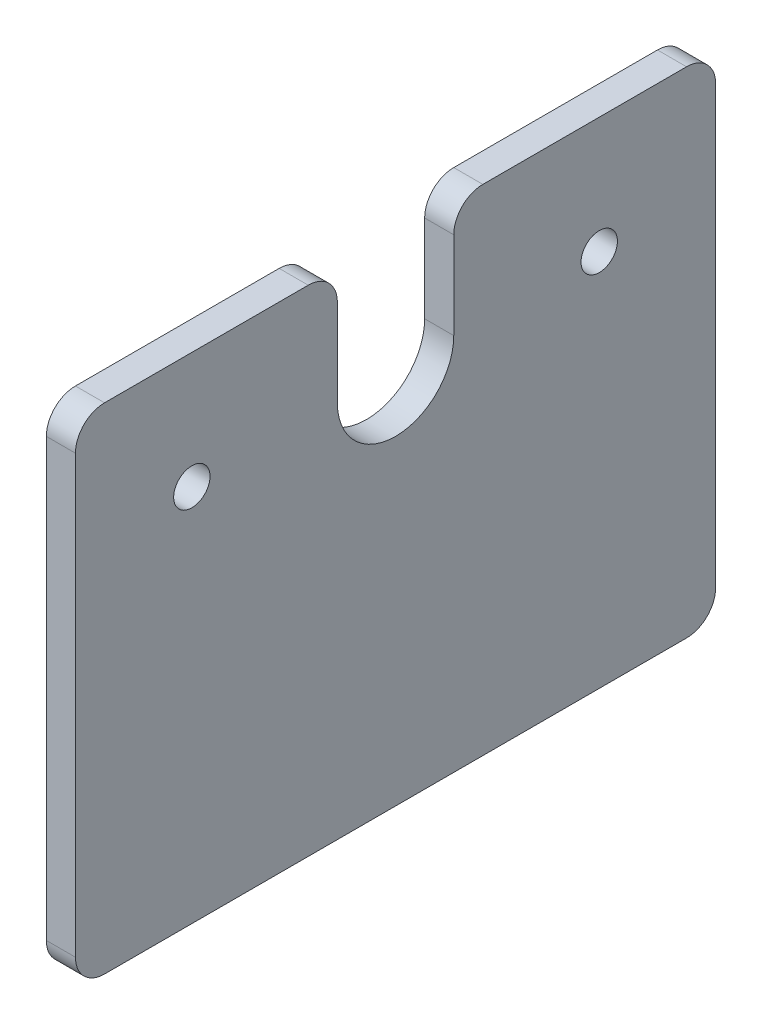
ISO-10303-21;
HEADER;
FILE_DESCRIPTION(('STEP AP214'),'2;1');
FILE_NAME('part.step','',(''),(''),'','','');
FILE_SCHEMA(('AUTOMOTIVE_DESIGN { 1 0 10303 214 1 1 1 1 }'));
ENDSEC;
DATA;
#1=APPLICATION_CONTEXT('core data for automotive mechanical design processes');
#2=APPLICATION_PROTOCOL_DEFINITION('international standard','automotive_design',2000,#1);
#3=PRODUCT_CONTEXT('',#1,'mechanical');
#4=PRODUCT('Part','Part','',(#3));
#5=PRODUCT_RELATED_PRODUCT_CATEGORY('part','',(#4));
#6=PRODUCT_DEFINITION_FORMATION('','',#4);
#7=PRODUCT_DEFINITION_CONTEXT('part definition',#1,'design');
#8=PRODUCT_DEFINITION('design','',#6,#7);
#9=PRODUCT_DEFINITION_SHAPE('','',#8);
#10=(LENGTH_UNIT() NAMED_UNIT(*) SI_UNIT(.MILLI.,.METRE.));
#11=(NAMED_UNIT(*) PLANE_ANGLE_UNIT() SI_UNIT($,.RADIAN.));
#12=(NAMED_UNIT(*) SI_UNIT($,.STERADIAN.) SOLID_ANGLE_UNIT());
#13=UNCERTAINTY_MEASURE_WITH_UNIT(LENGTH_MEASURE(1.E-05),#10,'distance_accuracy_value','');
#14=(GEOMETRIC_REPRESENTATION_CONTEXT(3) GLOBAL_UNCERTAINTY_ASSIGNED_CONTEXT((#13)) GLOBAL_UNIT_ASSIGNED_CONTEXT((#10,
#11,#12)) REPRESENTATION_CONTEXT('',''));
#15=CARTESIAN_POINT('',(0.,0.,0.));
#16=DIRECTION('',(0.,0.,1.));
#17=DIRECTION('',(1.,0.,0.));
#18=AXIS2_PLACEMENT_3D('',#15,#16,#17);
#19=CARTESIAN_POINT('',(512.,198.,307.5));
#20=DIRECTION('',(0.,1.,0.));
#21=DIRECTION('',(0.,0.,1.));
#22=AXIS2_PLACEMENT_3D('',#19,#20,#21);
#23=PLANE('',#22);
#24=DIRECTION('',(0.,0.,1.));
#25=VECTOR('',#24,1.);
#26=CARTESIAN_POINT('',(522.,198.,307.5));
#27=LINE('',#26,#25);
#28=CARTESIAN_POINT('',(522.,198.,227.5));
#29=VERTEX_POINT('',#28);
#30=CARTESIAN_POINT('',(522.,198.,297.5));
#31=VERTEX_POINT('',#30);
#32=EDGE_CURVE('E194',#29,#31,#27,.T.);
#33=ORIENTED_EDGE('',*,*,#32,.F.);
#34=DIRECTION('',(1.,0.,0.));
#35=VECTOR('',#34,1.);
#36=CARTESIAN_POINT('',(512.,198.,227.5));
#37=LINE('',#36,#35);
#38=CARTESIAN_POINT('',(512.,198.,227.5));
#39=VERTEX_POINT('',#38);
#40=EDGE_CURVE('E217',#29,#39,#37,.F.);
#41=ORIENTED_EDGE('',*,*,#40,.T.);
#42=DIRECTION('',(0.,0.,1.));
#43=VECTOR('',#42,1.);
#44=CARTESIAN_POINT('',(512.,198.,307.5));
#45=LINE('',#44,#43);
#46=CARTESIAN_POINT('',(512.,198.,297.5));
#47=VERTEX_POINT('',#46);
#48=EDGE_CURVE('E181',#39,#47,#45,.T.);
#49=ORIENTED_EDGE('',*,*,#48,.T.);
#50=DIRECTION('',(1.,0.,0.));
#51=VECTOR('',#50,1.);
#52=CARTESIAN_POINT('',(512.,198.,297.5));
#53=LINE('',#52,#51);
#54=EDGE_CURVE('E214',#47,#31,#53,.T.);
#55=ORIENTED_EDGE('',*,*,#54,.T.);
#56=EDGE_LOOP('',(#33,#41,#49,#55));
#57=FACE_BOUND('',#56,.T.);
#58=ADVANCED_FACE('F37',(#57),#23,.T.);
#59=CARTESIAN_POINT('',(512.,27.9999999999999,307.5));
#60=DIRECTION('',(0.,0.,1.));
#61=DIRECTION('',(1.,0.,0.));
#62=AXIS2_PLACEMENT_3D('',#59,#60,#61);
#63=PLANE('',#62);
#64=DIRECTION('',(0.,-1.,0.));
#65=VECTOR('',#64,1.);
#66=CARTESIAN_POINT('',(512.,27.9999999999999,307.5));
#67=LINE('',#66,#65);
#68=CARTESIAN_POINT('',(512.,188.,307.5));
#69=VERTEX_POINT('',#68);
#70=CARTESIAN_POINT('',(512.,37.9999999999999,307.5));
#71=VERTEX_POINT('',#70);
#72=EDGE_CURVE('E172',#69,#71,#67,.T.);
#73=ORIENTED_EDGE('',*,*,#72,.T.);
#74=DIRECTION('',(1.,0.,0.));
#75=VECTOR('',#74,1.);
#76=CARTESIAN_POINT('',(512.,37.9999999999999,307.5));
#77=LINE('',#76,#75);
#78=CARTESIAN_POINT('',(522.,37.9999999999999,307.5));
#79=VERTEX_POINT('',#78);
#80=EDGE_CURVE('E45',#71,#79,#77,.T.);
#81=ORIENTED_EDGE('',*,*,#80,.T.);
#82=DIRECTION('',(0.,-1.,0.));
#83=VECTOR('',#82,1.);
#84=CARTESIAN_POINT('',(522.,27.9999999999999,307.5));
#85=LINE('',#84,#83);
#86=CARTESIAN_POINT('',(522.,188.,307.5));
#87=VERTEX_POINT('',#86);
#88=EDGE_CURVE('E171',#87,#79,#85,.T.);
#89=ORIENTED_EDGE('',*,*,#88,.F.);
#90=DIRECTION('',(1.,0.,0.));
#91=VECTOR('',#90,1.);
#92=CARTESIAN_POINT('',(512.,188.,307.5));
#93=LINE('',#92,#91);
#94=EDGE_CURVE('E59',#87,#69,#93,.F.);
#95=ORIENTED_EDGE('',*,*,#94,.T.);
#96=EDGE_LOOP('',(#73,#81,#89,#95));
#97=FACE_BOUND('',#96,.T.);
#98=ADVANCED_FACE('F246',(#97),#63,.T.);
#99=CARTESIAN_POINT('',(522.,198.,97.4999999999998));
#100=VERTEX_POINT('',#99);
#101=CARTESIAN_POINT('',(522.,198.,167.5));
#102=VERTEX_POINT('',#101);
#103=EDGE_CURVE('E175',#100,#102,#27,.T.);
#104=ORIENTED_EDGE('',*,*,#103,.F.);
#105=DIRECTION('',(1.,0.,0.));
#106=VECTOR('',#105,1.);
#107=CARTESIAN_POINT('',(512.,198.,97.4999999999998));
#108=LINE('',#107,#106);
#109=CARTESIAN_POINT('',(512.,198.,97.4999999999998));
#110=VERTEX_POINT('',#109);
#111=EDGE_CURVE('E237',#100,#110,#108,.F.);
#112=ORIENTED_EDGE('',*,*,#111,.T.);
#113=CARTESIAN_POINT('',(512.,198.,167.5));
#114=VERTEX_POINT('',#113);
#115=EDGE_CURVE('E182',#110,#114,#45,.T.);
#116=ORIENTED_EDGE('',*,*,#115,.T.);
#117=DIRECTION('',(-1.,0.,0.));
#118=VECTOR('',#117,1.);
#119=CARTESIAN_POINT('',(522.,198.,167.5));
#120=LINE('',#119,#118);
#121=EDGE_CURVE('E235',#114,#102,#120,.F.);
#122=ORIENTED_EDGE('',*,*,#121,.T.);
#123=EDGE_LOOP('',(#104,#112,#116,#122));
#124=FACE_BOUND('',#123,.T.);
#125=ADVANCED_FACE('F297',(#124),#23,.T.);
#126=CARTESIAN_POINT('',(512.,27.9999999999999,87.4999999999998));
#127=DIRECTION('',(0.,0.,-1.));
#128=DIRECTION('',(-1.,0.,0.));
#129=AXIS2_PLACEMENT_3D('',#126,#127,#128);
#130=PLANE('',#129);
#131=DIRECTION('',(0.,1.,0.));
#132=VECTOR('',#131,1.);
#133=CARTESIAN_POINT('',(512.,27.9999999999999,87.4999999999998));
#134=LINE('',#133,#132);
#135=CARTESIAN_POINT('',(512.,37.9999999999999,87.4999999999998));
#136=VERTEX_POINT('',#135);
#137=CARTESIAN_POINT('',(512.,188.,87.4999999999998));
#138=VERTEX_POINT('',#137);
#139=EDGE_CURVE('E178',#136,#138,#134,.T.);
#140=ORIENTED_EDGE('',*,*,#139,.T.);
#141=DIRECTION('',(1.,0.,0.));
#142=VECTOR('',#141,1.);
#143=CARTESIAN_POINT('',(512.,188.,87.4999999999998));
#144=LINE('',#143,#142);
#145=CARTESIAN_POINT('',(522.,188.,87.4999999999998));
#146=VERTEX_POINT('',#145);
#147=EDGE_CURVE('E232',#138,#146,#144,.T.);
#148=ORIENTED_EDGE('',*,*,#147,.T.);
#149=DIRECTION('',(0.,1.,0.));
#150=VECTOR('',#149,1.);
#151=CARTESIAN_POINT('',(522.,27.9999999999999,87.4999999999998));
#152=LINE('',#151,#150);
#153=CARTESIAN_POINT('',(522.,37.9999999999999,87.4999999999998));
#154=VERTEX_POINT('',#153);
#155=EDGE_CURVE('E191',#154,#146,#152,.T.);
#156=ORIENTED_EDGE('',*,*,#155,.F.);
#157=DIRECTION('',(1.,0.,0.));
#158=VECTOR('',#157,1.);
#159=CARTESIAN_POINT('',(512.,37.9999999999999,87.4999999999998));
#160=LINE('',#159,#158);
#161=EDGE_CURVE('E230',#154,#136,#160,.F.);
#162=ORIENTED_EDGE('',*,*,#161,.T.);
#163=EDGE_LOOP('',(#140,#148,#156,#162));
#164=FACE_BOUND('',#163,.T.);
#165=ADVANCED_FACE('F290',(#164),#130,.T.);
#166=CARTESIAN_POINT('',(512.,27.9999999999999,307.5));
#167=DIRECTION('',(0.,-1.,0.));
#168=DIRECTION('',(0.,0.,-1.));
#169=AXIS2_PLACEMENT_3D('',#166,#167,#168);
#170=PLANE('',#169);
#171=DIRECTION('',(0.,0.,-1.));
#172=VECTOR('',#171,1.);
#173=CARTESIAN_POINT('',(512.,27.9999999999999,307.5));
#174=LINE('',#173,#172);
#175=CARTESIAN_POINT('',(512.,27.9999999999999,297.5));
#176=VERTEX_POINT('',#175);
#177=CARTESIAN_POINT('',(512.,27.9999999999999,97.4999999999998));
#178=VERTEX_POINT('',#177);
#179=EDGE_CURVE('E174',#176,#178,#174,.T.);
#180=ORIENTED_EDGE('',*,*,#179,.T.);
#181=DIRECTION('',(1.,0.,0.));
#182=VECTOR('',#181,1.);
#183=CARTESIAN_POINT('',(512.,27.9999999999999,97.4999999999998));
#184=LINE('',#183,#182);
#185=CARTESIAN_POINT('',(522.,27.9999999999999,97.4999999999998));
#186=VERTEX_POINT('',#185);
#187=EDGE_CURVE('E241',#178,#186,#184,.T.);
#188=ORIENTED_EDGE('',*,*,#187,.T.);
#189=DIRECTION('',(0.,0.,-1.));
#190=VECTOR('',#189,1.);
#191=CARTESIAN_POINT('',(522.,27.9999999999999,307.5));
#192=LINE('',#191,#190);
#193=CARTESIAN_POINT('',(522.,27.9999999999999,297.5));
#194=VERTEX_POINT('',#193);
#195=EDGE_CURVE('E188',#194,#186,#192,.T.);
#196=ORIENTED_EDGE('',*,*,#195,.F.);
#197=DIRECTION('',(1.,0.,0.));
#198=VECTOR('',#197,1.);
#199=CARTESIAN_POINT('',(512.,27.9999999999999,297.5));
#200=LINE('',#199,#198);
#201=EDGE_CURVE('E239',#194,#176,#200,.F.);
#202=ORIENTED_EDGE('',*,*,#201,.T.);
#203=EDGE_LOOP('',(#180,#188,#196,#202));
#204=FACE_BOUND('',#203,.T.);
#205=ADVANCED_FACE('F281',(#204),#170,.T.);
#206=CARTESIAN_POINT('',(512.,0.,0.));
#207=DIRECTION('',(-1.,0.,0.));
#208=DIRECTION('',(0.,0.,1.));
#209=AXIS2_PLACEMENT_3D('',#206,#207,#208);
#210=PLANE('',#209);
#211=CARTESIAN_POINT('',(512.,158.,267.5));
#212=DIRECTION('',(-1.,0.,0.));
#213=DIRECTION('',(0.,0.,-1.));
#214=AXIS2_PLACEMENT_3D('',#211,#212,#213);
#215=CIRCLE('',#214,6.25);
#216=CARTESIAN_POINT('',(512.,158.,261.25));
#217=VERTEX_POINT('',#216);
#218=EDGE_CURVE('E270',#217,#217,#215,.T.);
#219=ORIENTED_EDGE('',*,*,#218,.F.);
#220=EDGE_LOOP('',(#219));
#221=FACE_BOUND('',#220,.T.);
#222=CARTESIAN_POINT('',(512.,158.,127.5));
#223=DIRECTION('',(-1.,0.,0.));
#224=DIRECTION('',(0.,0.,1.));
#225=AXIS2_PLACEMENT_3D('',#222,#223,#224);
#226=CIRCLE('',#225,6.25);
#227=CARTESIAN_POINT('',(512.,158.,133.75));
#228=VERTEX_POINT('',#227);
#229=EDGE_CURVE('E269',#228,#228,#226,.T.);
#230=ORIENTED_EDGE('',*,*,#229,.F.);
#231=EDGE_LOOP('',(#230));
#232=FACE_BOUND('',#231,.T.);
#233=ORIENTED_EDGE('',*,*,#48,.F.);
#234=CARTESIAN_POINT('',(512.,188.,227.5));
#235=DIRECTION('',(-1.,0.,0.));
#236=DIRECTION('',(0.,0.,1.));
#237=AXIS2_PLACEMENT_3D('',#234,#235,#236);
#238=CIRCLE('',#237,10.);
#239=CARTESIAN_POINT('',(512.,188.,217.5));
#240=VERTEX_POINT('',#239);
#241=EDGE_CURVE('E228',#39,#240,#238,.T.);
#242=ORIENTED_EDGE('',*,*,#241,.T.);
#243=DIRECTION('',(0.,1.,0.));
#244=VECTOR('',#243,1.);
#245=CARTESIAN_POINT('',(512.,238.,217.5));
#246=LINE('',#245,#244);
#247=CARTESIAN_POINT('',(512.,158.,217.5));
#248=VERTEX_POINT('',#247);
#249=EDGE_CURVE('E159',#248,#240,#246,.T.);
#250=ORIENTED_EDGE('',*,*,#249,.F.);
#251=CARTESIAN_POINT('',(512.,158.,197.5));
#252=DIRECTION('',(-1.,0.,0.));
#253=DIRECTION('',(0.,0.,1.));
#254=AXIS2_PLACEMENT_3D('',#251,#252,#253);
#255=CIRCLE('',#254,19.9999999999999);
#256=CARTESIAN_POINT('',(512.,158.,177.5));
#257=VERTEX_POINT('',#256);
#258=EDGE_CURVE('E147',#257,#248,#255,.T.);
#259=ORIENTED_EDGE('',*,*,#258,.F.);
#260=DIRECTION('',(0.,-1.,0.));
#261=VECTOR('',#260,1.);
#262=CARTESIAN_POINT('',(512.,238.,177.5));
#263=LINE('',#262,#261);
#264=CARTESIAN_POINT('',(512.,188.,177.5));
#265=VERTEX_POINT('',#264);
#266=EDGE_CURVE('E139',#265,#257,#263,.T.);
#267=ORIENTED_EDGE('',*,*,#266,.F.);
#268=CARTESIAN_POINT('',(512.,188.,167.5));
#269=DIRECTION('',(-1.,0.,0.));
#270=DIRECTION('',(0.,0.,1.));
#271=AXIS2_PLACEMENT_3D('',#268,#269,#270);
#272=CIRCLE('',#271,10.);
#273=EDGE_CURVE('E221',#265,#114,#272,.T.);
#274=ORIENTED_EDGE('',*,*,#273,.T.);
#275=ORIENTED_EDGE('',*,*,#115,.F.);
#276=CARTESIAN_POINT('',(512.,188.,97.4999999999998));
#277=DIRECTION('',(-1.,0.,0.));
#278=DIRECTION('',(0.,0.,1.));
#279=AXIS2_PLACEMENT_3D('',#276,#277,#278);
#280=CIRCLE('',#279,10.);
#281=EDGE_CURVE('E226',#110,#138,#280,.T.);
#282=ORIENTED_EDGE('',*,*,#281,.T.);
#283=ORIENTED_EDGE('',*,*,#139,.F.);
#284=CARTESIAN_POINT('',(512.,37.9999999999999,97.4999999999998));
#285=DIRECTION('',(-1.,0.,0.));
#286=DIRECTION('',(0.,0.,1.));
#287=AXIS2_PLACEMENT_3D('',#284,#285,#286);
#288=CIRCLE('',#287,10.);
#289=EDGE_CURVE('E224',#136,#178,#288,.T.);
#290=ORIENTED_EDGE('',*,*,#289,.T.);
#291=ORIENTED_EDGE('',*,*,#179,.F.);
#292=CARTESIAN_POINT('',(512.,37.9999999999999,297.5));
#293=DIRECTION('',(-1.,0.,0.));
#294=DIRECTION('',(0.,0.,1.));
#295=AXIS2_PLACEMENT_3D('',#292,#293,#294);
#296=CIRCLE('',#295,10.);
#297=EDGE_CURVE('E52',#176,#71,#296,.T.);
#298=ORIENTED_EDGE('',*,*,#297,.T.);
#299=ORIENTED_EDGE('',*,*,#72,.F.);
#300=CARTESIAN_POINT('',(512.,188.,297.5));
#301=DIRECTION('',(-1.,0.,0.));
#302=DIRECTION('',(0.,0.,1.));
#303=AXIS2_PLACEMENT_3D('',#300,#301,#302);
#304=CIRCLE('',#303,10.);
#305=EDGE_CURVE('E219',#69,#47,#304,.T.);
#306=ORIENTED_EDGE('',*,*,#305,.T.);
#307=EDGE_LOOP('',(#233,#242,#250,#259,#267,#274,#275,#282,#283,#290,#291,#298,#299,#306));
#308=FACE_BOUND('',#307,.T.);
#309=ADVANCED_FACE('F162',(#221,#232,#308),#210,.T.);
#310=CARTESIAN_POINT('',(522.,0.,0.));
#311=DIRECTION('',(-1.,0.,0.));
#312=DIRECTION('',(0.,0.,1.));
#313=AXIS2_PLACEMENT_3D('',#310,#311,#312);
#314=PLANE('',#313);
#315=CARTESIAN_POINT('',(522.,158.,267.5));
#316=DIRECTION('',(-1.,0.,0.));
#317=DIRECTION('',(0.,0.,1.));
#318=AXIS2_PLACEMENT_3D('',#315,#316,#317);
#319=CIRCLE('',#318,6.25);
#320=CARTESIAN_POINT('',(522.,158.,273.75));
#321=VERTEX_POINT('',#320);
#322=EDGE_CURVE('E266',#321,#321,#319,.F.);
#323=ORIENTED_EDGE('',*,*,#322,.F.);
#324=EDGE_LOOP('',(#323));
#325=FACE_BOUND('',#324,.T.);
#326=CARTESIAN_POINT('',(522.,158.,127.5));
#327=DIRECTION('',(-1.,0.,0.));
#328=DIRECTION('',(0.,0.,1.));
#329=AXIS2_PLACEMENT_3D('',#326,#327,#328);
#330=CIRCLE('',#329,6.25);
#331=CARTESIAN_POINT('',(522.,158.,133.75));
#332=VERTEX_POINT('',#331);
#333=EDGE_CURVE('E148',#332,#332,#330,.F.);
#334=ORIENTED_EDGE('',*,*,#333,.F.);
#335=EDGE_LOOP('',(#334));
#336=FACE_BOUND('',#335,.T.);
#337=DIRECTION('',(0.,1.,0.));
#338=VECTOR('',#337,1.);
#339=CARTESIAN_POINT('',(522.,0.,217.5));
#340=LINE('',#339,#338);
#341=CARTESIAN_POINT('',(522.,158.,217.5));
#342=VERTEX_POINT('',#341);
#343=CARTESIAN_POINT('',(522.,188.,217.5));
#344=VERTEX_POINT('',#343);
#345=EDGE_CURVE('E185',#342,#344,#340,.T.);
#346=ORIENTED_EDGE('',*,*,#345,.T.);
#347=CARTESIAN_POINT('',(522.,188.,227.5));
#348=DIRECTION('',(-1.,0.,0.));
#349=DIRECTION('',(0.,0.,1.));
#350=AXIS2_PLACEMENT_3D('',#347,#348,#349);
#351=CIRCLE('',#350,10.);
#352=EDGE_CURVE('E212',#344,#29,#351,.F.);
#353=ORIENTED_EDGE('',*,*,#352,.T.);
#354=ORIENTED_EDGE('',*,*,#32,.T.);
#355=CARTESIAN_POINT('',(522.,188.,297.5));
#356=DIRECTION('',(-1.,0.,0.));
#357=DIRECTION('',(0.,0.,1.));
#358=AXIS2_PLACEMENT_3D('',#355,#356,#357);
#359=CIRCLE('',#358,10.);
#360=EDGE_CURVE('E202',#31,#87,#359,.F.);
#361=ORIENTED_EDGE('',*,*,#360,.T.);
#362=ORIENTED_EDGE('',*,*,#88,.T.);
#363=CARTESIAN_POINT('',(522.,37.9999999999999,297.5));
#364=DIRECTION('',(-1.,0.,0.));
#365=DIRECTION('',(0.,0.,1.));
#366=AXIS2_PLACEMENT_3D('',#363,#364,#365);
#367=CIRCLE('',#366,10.);
#368=EDGE_CURVE('E206',#79,#194,#367,.F.);
#369=ORIENTED_EDGE('',*,*,#368,.T.);
#370=ORIENTED_EDGE('',*,*,#195,.T.);
#371=CARTESIAN_POINT('',(522.,37.9999999999999,97.4999999999998));
#372=DIRECTION('',(-1.,0.,0.));
#373=DIRECTION('',(0.,0.,1.));
#374=AXIS2_PLACEMENT_3D('',#371,#372,#373);
#375=CIRCLE('',#374,10.);
#376=EDGE_CURVE('E208',#186,#154,#375,.F.);
#377=ORIENTED_EDGE('',*,*,#376,.T.);
#378=ORIENTED_EDGE('',*,*,#155,.T.);
#379=CARTESIAN_POINT('',(522.,188.,97.4999999999998));
#380=DIRECTION('',(-1.,0.,0.));
#381=DIRECTION('',(0.,0.,1.));
#382=AXIS2_PLACEMENT_3D('',#379,#380,#381);
#383=CIRCLE('',#382,10.);
#384=EDGE_CURVE('E210',#146,#100,#383,.F.);
#385=ORIENTED_EDGE('',*,*,#384,.T.);
#386=ORIENTED_EDGE('',*,*,#103,.T.);
#387=CARTESIAN_POINT('',(522.,188.,167.5));
#388=DIRECTION('',(-1.,0.,0.));
#389=DIRECTION('',(0.,0.,1.));
#390=AXIS2_PLACEMENT_3D('',#387,#388,#389);
#391=CIRCLE('',#390,10.);
#392=CARTESIAN_POINT('',(522.,188.,177.5));
#393=VERTEX_POINT('',#392);
#394=EDGE_CURVE('E204',#102,#393,#391,.F.);
#395=ORIENTED_EDGE('',*,*,#394,.T.);
#396=DIRECTION('',(0.,1.,0.));
#397=VECTOR('',#396,1.);
#398=CARTESIAN_POINT('',(522.,238.,177.5));
#399=LINE('',#398,#397);
#400=CARTESIAN_POINT('',(522.,158.,177.5));
#401=VERTEX_POINT('',#400);
#402=EDGE_CURVE('E169',#401,#393,#399,.T.);
#403=ORIENTED_EDGE('',*,*,#402,.F.);
#404=CARTESIAN_POINT('',(522.,158.,197.5));
#405=DIRECTION('',(-1.,0.,0.));
#406=DIRECTION('',(0.,0.,1.));
#407=AXIS2_PLACEMENT_3D('',#404,#405,#406);
#408=CIRCLE('',#407,19.9999999999999);
#409=EDGE_CURVE('E156',#342,#401,#408,.F.);
#410=ORIENTED_EDGE('',*,*,#409,.F.);
#411=EDGE_LOOP('',(#346,#353,#354,#361,#362,#369,#370,#377,#378,#385,#386,#395,#403,#410));
#412=FACE_BOUND('',#411,.T.);
#413=ADVANCED_FACE('F249',(#325,#336,#412),#314,.F.);
#414=CARTESIAN_POINT('',(648.491106406735,238.,217.5));
#415=DIRECTION('',(0.,0.,1.));
#416=DIRECTION('',(1.,0.,0.));
#417=AXIS2_PLACEMENT_3D('',#414,#415,#416);
#418=PLANE('',#417);
#419=ORIENTED_EDGE('',*,*,#249,.T.);
#420=DIRECTION('',(1.,0.,0.));
#421=VECTOR('',#420,1.);
#422=CARTESIAN_POINT('',(522.,188.,217.5));
#423=LINE('',#422,#421);
#424=EDGE_CURVE('E199',#240,#344,#423,.T.);
#425=ORIENTED_EDGE('',*,*,#424,.T.);
#426=ORIENTED_EDGE('',*,*,#345,.F.);
#427=DIRECTION('',(-1.,0.,0.));
#428=VECTOR('',#427,1.);
#429=CARTESIAN_POINT('',(648.491106406735,158.,217.5));
#430=LINE('',#429,#428);
#431=EDGE_CURVE('E158',#342,#248,#430,.T.);
#432=ORIENTED_EDGE('',*,*,#431,.T.);
#433=EDGE_LOOP('',(#419,#425,#426,#432));
#434=FACE_BOUND('',#433,.T.);
#435=ADVANCED_FACE('F264',(#434),#418,.F.);
#436=CARTESIAN_POINT('',(648.491106406735,158.,197.5));
#437=DIRECTION('',(-1.,0.,0.));
#438=DIRECTION('',(0.,0.,1.));
#439=AXIS2_PLACEMENT_3D('',#436,#437,#438);
#440=CYLINDRICAL_SURFACE('',#439,19.9999999999999);
#441=ORIENTED_EDGE('',*,*,#409,.T.);
#442=DIRECTION('',(-1.,0.,0.));
#443=VECTOR('',#442,1.);
#444=CARTESIAN_POINT('',(648.491106406735,158.,177.5));
#445=LINE('',#444,#443);
#446=EDGE_CURVE('E143',#401,#257,#445,.T.);
#447=ORIENTED_EDGE('',*,*,#446,.T.);
#448=ORIENTED_EDGE('',*,*,#258,.T.);
#449=ORIENTED_EDGE('',*,*,#431,.F.);
#450=EDGE_LOOP('',(#441,#447,#448,#449));
#451=FACE_BOUND('',#450,.T.);
#452=ADVANCED_FACE('F152',(#451),#440,.F.);
#453=CARTESIAN_POINT('',(648.491106406735,238.,177.5));
#454=DIRECTION('',(0.,0.,-1.));
#455=DIRECTION('',(-1.,0.,0.));
#456=AXIS2_PLACEMENT_3D('',#453,#454,#455);
#457=PLANE('',#456);
#458=ORIENTED_EDGE('',*,*,#402,.T.);
#459=DIRECTION('',(-1.,0.,0.));
#460=VECTOR('',#459,1.);
#461=CARTESIAN_POINT('',(512.,188.,177.5));
#462=LINE('',#461,#460);
#463=EDGE_CURVE('E11',#393,#265,#462,.T.);
#464=ORIENTED_EDGE('',*,*,#463,.T.);
#465=ORIENTED_EDGE('',*,*,#266,.T.);
#466=ORIENTED_EDGE('',*,*,#446,.F.);
#467=EDGE_LOOP('',(#458,#464,#465,#466));
#468=FACE_BOUND('',#467,.T.);
#469=ADVANCED_FACE('F142',(#468),#457,.F.);
#470=CARTESIAN_POINT('',(648.491106406735,158.,127.5));
#471=DIRECTION('',(-1.,0.,0.));
#472=DIRECTION('',(0.,0.,1.));
#473=AXIS2_PLACEMENT_3D('',#470,#471,#472);
#474=CYLINDRICAL_SURFACE('',#473,6.25);
#475=ORIENTED_EDGE('',*,*,#333,.T.);
#476=EDGE_LOOP('',(#475));
#477=FACE_BOUND('',#476,.T.);
#478=ORIENTED_EDGE('',*,*,#229,.T.);
#479=EDGE_LOOP('',(#478));
#480=FACE_BOUND('',#479,.T.);
#481=ADVANCED_FACE('F278',(#477,#480),#474,.F.);
#482=CARTESIAN_POINT('',(648.491106406735,158.,267.5));
#483=DIRECTION('',(-1.,0.,0.));
#484=DIRECTION('',(0.,0.,1.));
#485=AXIS2_PLACEMENT_3D('',#482,#483,#484);
#486=CYLINDRICAL_SURFACE('',#485,6.25);
#487=ORIENTED_EDGE('',*,*,#322,.T.);
#488=EDGE_LOOP('',(#487));
#489=FACE_BOUND('',#488,.T.);
#490=ORIENTED_EDGE('',*,*,#218,.T.);
#491=EDGE_LOOP('',(#490));
#492=FACE_BOUND('',#491,.T.);
#493=ADVANCED_FACE('F340',(#489,#492),#486,.F.);
#494=CARTESIAN_POINT('',(648.491106406735,188.,227.5));
#495=DIRECTION('',(-1.,0.,0.));
#496=DIRECTION('',(0.,0.,1.));
#497=AXIS2_PLACEMENT_3D('',#494,#495,#496);
#498=CYLINDRICAL_SURFACE('',#497,10.);
#499=ORIENTED_EDGE('',*,*,#241,.F.);
#500=ORIENTED_EDGE('',*,*,#40,.F.);
#501=ORIENTED_EDGE('',*,*,#352,.F.);
#502=ORIENTED_EDGE('',*,*,#424,.F.);
#503=EDGE_LOOP('',(#499,#500,#501,#502));
#504=FACE_BOUND('',#503,.T.);
#505=ADVANCED_FACE('F262',(#504),#498,.T.);
#506=CARTESIAN_POINT('',(512.,188.,97.4999999999998));
#507=DIRECTION('',(1.,0.,0.));
#508=DIRECTION('',(0.,0.,-1.));
#509=AXIS2_PLACEMENT_3D('',#506,#507,#508);
#510=CYLINDRICAL_SURFACE('',#509,10.);
#511=ORIENTED_EDGE('',*,*,#281,.F.);
#512=ORIENTED_EDGE('',*,*,#111,.F.);
#513=ORIENTED_EDGE('',*,*,#384,.F.);
#514=ORIENTED_EDGE('',*,*,#147,.F.);
#515=EDGE_LOOP('',(#511,#512,#513,#514));
#516=FACE_BOUND('',#515,.T.);
#517=ADVANCED_FACE('F316',(#516),#510,.T.);
#518=CARTESIAN_POINT('',(512.,37.9999999999999,97.4999999999998));
#519=DIRECTION('',(1.,0.,0.));
#520=DIRECTION('',(0.,0.,-1.));
#521=AXIS2_PLACEMENT_3D('',#518,#519,#520);
#522=CYLINDRICAL_SURFACE('',#521,10.);
#523=ORIENTED_EDGE('',*,*,#289,.F.);
#524=ORIENTED_EDGE('',*,*,#161,.F.);
#525=ORIENTED_EDGE('',*,*,#376,.F.);
#526=ORIENTED_EDGE('',*,*,#187,.F.);
#527=EDGE_LOOP('',(#523,#524,#525,#526));
#528=FACE_BOUND('',#527,.T.);
#529=ADVANCED_FACE('F323',(#528),#522,.T.);
#530=CARTESIAN_POINT('',(512.,37.9999999999999,297.5));
#531=DIRECTION('',(1.,0.,0.));
#532=DIRECTION('',(0.,0.,-1.));
#533=AXIS2_PLACEMENT_3D('',#530,#531,#532);
#534=CYLINDRICAL_SURFACE('',#533,10.);
#535=ORIENTED_EDGE('',*,*,#297,.F.);
#536=ORIENTED_EDGE('',*,*,#201,.F.);
#537=ORIENTED_EDGE('',*,*,#368,.F.);
#538=ORIENTED_EDGE('',*,*,#80,.F.);
#539=EDGE_LOOP('',(#535,#536,#537,#538));
#540=FACE_BOUND('',#539,.T.);
#541=ADVANCED_FACE('F326',(#540),#534,.T.);
#542=CARTESIAN_POINT('',(648.491106406735,188.,167.5));
#543=DIRECTION('',(1.,0.,0.));
#544=DIRECTION('',(0.,0.,-1.));
#545=AXIS2_PLACEMENT_3D('',#542,#543,#544);
#546=CYLINDRICAL_SURFACE('',#545,10.);
#547=ORIENTED_EDGE('',*,*,#394,.F.);
#548=ORIENTED_EDGE('',*,*,#121,.F.);
#549=ORIENTED_EDGE('',*,*,#273,.F.);
#550=ORIENTED_EDGE('',*,*,#463,.F.);
#551=EDGE_LOOP('',(#547,#548,#549,#550));
#552=FACE_BOUND('',#551,.T.);
#553=ADVANCED_FACE('F328',(#552),#546,.T.);
#554=CARTESIAN_POINT('',(512.,188.,297.5));
#555=DIRECTION('',(1.,0.,0.));
#556=DIRECTION('',(0.,0.,-1.));
#557=AXIS2_PLACEMENT_3D('',#554,#555,#556);
#558=CYLINDRICAL_SURFACE('',#557,10.);
#559=ORIENTED_EDGE('',*,*,#305,.F.);
#560=ORIENTED_EDGE('',*,*,#94,.F.);
#561=ORIENTED_EDGE('',*,*,#360,.F.);
#562=ORIENTED_EDGE('',*,*,#54,.F.);
#563=EDGE_LOOP('',(#559,#560,#561,#562));
#564=FACE_BOUND('',#563,.T.);
#565=ADVANCED_FACE('F39',(#564),#558,.T.);
#566=CLOSED_SHELL('',(#58,#98,#125,#165,#205,#309,#413,#435,#452,#469,#481,#493,#505,#517,#529,
#541,#553,#565));
#567=MANIFOLD_SOLID_BREP('B2',#566);
#568=ADVANCED_BREP_SHAPE_REPRESENTATION('',(#18,#567),#14);
#569=SHAPE_DEFINITION_REPRESENTATION(#9,#568);
ENDSEC;
END-ISO-10303-21;
